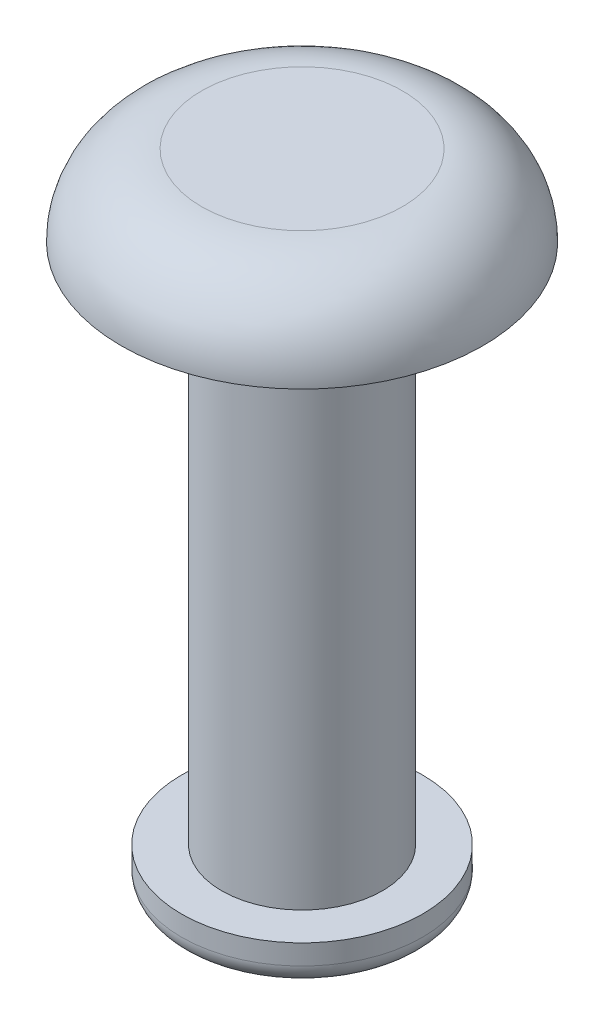
ISO-10303-21;
HEADER;
FILE_DESCRIPTION(('STEP AP214'),'2;1');
FILE_NAME('part.step','',(''),(''),'','','');
FILE_SCHEMA(('AUTOMOTIVE_DESIGN { 1 0 10303 214 1 1 1 1 }'));
ENDSEC;
DATA;
#1=APPLICATION_CONTEXT('core data for automotive mechanical design processes');
#2=APPLICATION_PROTOCOL_DEFINITION('international standard','automotive_design',2000,#1);
#3=PRODUCT_CONTEXT('',#1,'mechanical');
#4=PRODUCT('Part','Part','',(#3));
#5=PRODUCT_RELATED_PRODUCT_CATEGORY('part','',(#4));
#6=PRODUCT_DEFINITION_FORMATION('','',#4);
#7=PRODUCT_DEFINITION_CONTEXT('part definition',#1,'design');
#8=PRODUCT_DEFINITION('design','',#6,#7);
#9=PRODUCT_DEFINITION_SHAPE('','',#8);
#10=(LENGTH_UNIT() NAMED_UNIT(*) SI_UNIT(.MILLI.,.METRE.));
#11=(NAMED_UNIT(*) PLANE_ANGLE_UNIT() SI_UNIT($,.RADIAN.));
#12=(NAMED_UNIT(*) SI_UNIT($,.STERADIAN.) SOLID_ANGLE_UNIT());
#13=UNCERTAINTY_MEASURE_WITH_UNIT(LENGTH_MEASURE(1.E-05),#10,'distance_accuracy_value','');
#14=(GEOMETRIC_REPRESENTATION_CONTEXT(3) GLOBAL_UNCERTAINTY_ASSIGNED_CONTEXT((#13)) GLOBAL_UNIT_ASSIGNED_CONTEXT((#10,
#11,#12)) REPRESENTATION_CONTEXT('',''));
#15=CARTESIAN_POINT('',(0.,0.,0.));
#16=DIRECTION('',(0.,0.,1.));
#17=DIRECTION('',(1.,0.,0.));
#18=AXIS2_PLACEMENT_3D('',#15,#16,#17);
#19=CARTESIAN_POINT('',(0.,2.,0.));
#20=DIRECTION('',(0.,1.,0.));
#21=DIRECTION('',(0.,0.,1.));
#22=AXIS2_PLACEMENT_3D('',#19,#20,#21);
#23=PLANE('',#22);
#24=CARTESIAN_POINT('',(0.,2.,0.));
#25=DIRECTION('',(0.,1.,0.));
#26=DIRECTION('',(0.,0.,1.));
#27=AXIS2_PLACEMENT_3D('',#24,#25,#26);
#28=CIRCLE('',#27,2.5);
#29=CARTESIAN_POINT('',(0.,2.,2.5));
#30=VERTEX_POINT('',#29);
#31=EDGE_CURVE('E45',#30,#30,#28,.T.);
#32=ORIENTED_EDGE('',*,*,#31,.T.);
#33=EDGE_LOOP('',(#32));
#34=FACE_BOUND('',#33,.T.);
#35=ADVANCED_FACE('F34',(#34),#23,.T.);
#36=CARTESIAN_POINT('',(0.,0.,0.));
#37=DIRECTION('',(0.,1.,0.));
#38=DIRECTION('',(0.,0.,1.));
#39=AXIS2_PLACEMENT_3D('',#36,#37,#38);
#40=PLANE('',#39);
#41=CARTESIAN_POINT('',(0.,0.,0.));
#42=DIRECTION('',(0.,-1.,0.));
#43=DIRECTION('',(0.,0.,-1.));
#44=AXIS2_PLACEMENT_3D('',#41,#42,#43);
#45=CIRCLE('',#44,2.);
#46=CARTESIAN_POINT('',(0.,0.,2.));
#47=VERTEX_POINT('',#46);
#48=EDGE_CURVE('E49',#47,#47,#45,.T.);
#49=ORIENTED_EDGE('',*,*,#48,.F.);
#50=EDGE_LOOP('',(#49));
#51=FACE_BOUND('',#50,.T.);
#52=CARTESIAN_POINT('',(0.,0.,0.));
#53=DIRECTION('',(0.,1.,0.));
#54=DIRECTION('',(0.,0.,1.));
#55=AXIS2_PLACEMENT_3D('',#52,#53,#54);
#56=CIRCLE('',#55,4.5);
#57=CARTESIAN_POINT('',(0.,0.,4.5));
#58=VERTEX_POINT('',#57);
#59=EDGE_CURVE('E52',#58,#58,#56,.T.);
#60=ORIENTED_EDGE('',*,*,#59,.F.);
#61=EDGE_LOOP('',(#60));
#62=FACE_BOUND('',#61,.T.);
#63=ADVANCED_FACE('F79',(#51,#62),#40,.F.);
#64=CARTESIAN_POINT('',(0.,-13.,0.));
#65=DIRECTION('',(0.,1.,0.));
#66=DIRECTION('',(0.,0.,1.));
#67=AXIS2_PLACEMENT_3D('',#64,#65,#66);
#68=CYLINDRICAL_SURFACE('',#67,2.);
#69=CARTESIAN_POINT('',(0.,-13.,0.));
#70=DIRECTION('',(0.,-1.,0.));
#71=DIRECTION('',(0.,0.,-1.));
#72=AXIS2_PLACEMENT_3D('',#69,#70,#71);
#73=CIRCLE('',#72,2.);
#74=CARTESIAN_POINT('',(0.,-13.,2.));
#75=VERTEX_POINT('',#74);
#76=EDGE_CURVE('E55',#75,#75,#73,.T.);
#77=CARTESIAN_POINT('',(0.,-13.,2.));
#78=CARTESIAN_POINT('',(0.,-12.8645833333333,2.));
#79=CARTESIAN_POINT('',(0.,-12.7291666666667,2.));
#80=CARTESIAN_POINT('',(0.,-12.4583333333333,2.));
#81=CARTESIAN_POINT('',(0.,-12.3229166666667,2.));
#82=CARTESIAN_POINT('',(0.,-12.0520833333333,2.));
#83=CARTESIAN_POINT('',(0.,-11.9166666666667,2.));
#84=CARTESIAN_POINT('',(0.,-11.6458333333333,2.));
#85=CARTESIAN_POINT('',(0.,-11.5104166666667,2.));
#86=CARTESIAN_POINT('',(0.,-11.2395833333333,2.));
#87=CARTESIAN_POINT('',(0.,-11.1041666666667,2.));
#88=CARTESIAN_POINT('',(0.,-10.8333333333333,2.));
#89=CARTESIAN_POINT('',(0.,-10.6979166666667,2.));
#90=CARTESIAN_POINT('',(0.,-10.4270833333333,2.));
#91=CARTESIAN_POINT('',(0.,-10.2916666666667,2.));
#92=CARTESIAN_POINT('',(0.,-10.0208333333333,2.));
#93=CARTESIAN_POINT('',(0.,-9.88541666666667,2.));
#94=CARTESIAN_POINT('',(0.,-9.61458333333333,2.));
#95=CARTESIAN_POINT('',(0.,-9.47916666666667,2.));
#96=CARTESIAN_POINT('',(0.,-9.20833333333333,2.));
#97=CARTESIAN_POINT('',(0.,-9.07291666666666,2.));
#98=CARTESIAN_POINT('',(0.,-8.80208333333333,2.));
#99=CARTESIAN_POINT('',(0.,-8.66666666666667,2.));
#100=CARTESIAN_POINT('',(0.,-8.39583333333333,2.));
#101=CARTESIAN_POINT('',(0.,-8.26041666666667,2.));
#102=CARTESIAN_POINT('',(0.,-7.98958333333333,2.));
#103=CARTESIAN_POINT('',(0.,-7.85416666666667,2.));
#104=CARTESIAN_POINT('',(0.,-7.58333333333333,2.));
#105=CARTESIAN_POINT('',(0.,-7.44791666666667,2.));
#106=CARTESIAN_POINT('',(0.,-7.17708333333333,2.));
#107=CARTESIAN_POINT('',(0.,-7.04166666666667,2.));
#108=CARTESIAN_POINT('',(0.,-6.77083333333333,2.));
#109=CARTESIAN_POINT('',(0.,-6.63541666666667,2.));
#110=CARTESIAN_POINT('',(0.,-6.36458333333333,2.));
#111=CARTESIAN_POINT('',(0.,-6.22916666666667,2.));
#112=CARTESIAN_POINT('',(0.,-5.95833333333333,2.));
#113=CARTESIAN_POINT('',(0.,-5.82291666666667,2.));
#114=CARTESIAN_POINT('',(0.,-5.55208333333333,2.));
#115=CARTESIAN_POINT('',(0.,-5.41666666666667,2.));
#116=CARTESIAN_POINT('',(0.,-5.14583333333333,2.));
#117=CARTESIAN_POINT('',(0.,-5.01041666666667,2.));
#118=CARTESIAN_POINT('',(0.,-4.73958333333333,2.));
#119=CARTESIAN_POINT('',(0.,-4.60416666666667,2.));
#120=CARTESIAN_POINT('',(0.,-4.33333333333333,2.));
#121=CARTESIAN_POINT('',(0.,-4.19791666666667,2.));
#122=CARTESIAN_POINT('',(0.,-3.92708333333333,2.));
#123=CARTESIAN_POINT('',(0.,-3.79166666666667,2.));
#124=CARTESIAN_POINT('',(0.,-3.52083333333333,2.));
#125=CARTESIAN_POINT('',(0.,-3.38541666666667,2.));
#126=CARTESIAN_POINT('',(0.,-3.11458333333333,2.));
#127=CARTESIAN_POINT('',(0.,-2.97916666666667,2.));
#128=CARTESIAN_POINT('',(0.,-2.70833333333333,2.));
#129=CARTESIAN_POINT('',(0.,-2.57291666666667,2.));
#130=CARTESIAN_POINT('',(0.,-2.30208333333333,2.));
#131=CARTESIAN_POINT('',(0.,-2.16666666666667,2.));
#132=CARTESIAN_POINT('',(0.,-1.89583333333333,2.));
#133=CARTESIAN_POINT('',(0.,-1.76041666666667,2.));
#134=CARTESIAN_POINT('',(0.,-1.48958333333333,2.));
#135=CARTESIAN_POINT('',(0.,-1.35416666666667,2.));
#136=CARTESIAN_POINT('',(0.,-1.08333333333333,2.));
#137=CARTESIAN_POINT('',(0.,-0.947916666666667,2.));
#138=CARTESIAN_POINT('',(0.,-0.677083333333334,2.));
#139=CARTESIAN_POINT('',(0.,-0.541666666666667,2.));
#140=CARTESIAN_POINT('',(0.,-0.270833333333334,2.));
#141=CARTESIAN_POINT('',(0.,-0.135416666666667,2.));
#142=CARTESIAN_POINT('',(0.,0.,2.));
#143=B_SPLINE_CURVE_WITH_KNOTS('',3,(#77,#78,#79,#80,#81,#82,#83,#84,#85,#86,#87,#88,#89,#90,
#91,#92,#93,#94,#95,#96,#97,#98,#99,#100,#101,#102,#103,#104,#105,#106,#107,#108,#109,#110,#111,
#112,#113,#114,#115,#116,#117,#118,#119,#120,#121,#122,#123,#124,#125,#126,#127,#128,#129,#130,
#131,#132,#133,#134,#135,#136,#137,#138,#139,#140,#141,#142),.UNSPECIFIED.,.F.,.F.,(4,2,2,2,2,2,
2,2,2,2,2,2,2,2,2,2,2,2,2,2,2,2,2,2,2,2,2,2,2,2,2,2,4),(0.,0.40625,0.812500000000001,1.21875,
1.625,2.03125,2.4375,2.84375,3.25,3.65625,4.0625,4.46875,4.875,5.28125,5.6875,6.09375,6.5,
6.90625,7.3125,7.71875,8.125,8.53125,8.9375,9.34375,9.75,10.15625,10.5625,10.96875,11.375,
11.78125,12.1875,12.59375,13.),.UNSPECIFIED.);
#144=EDGE_CURVE('BSEAM85',#75,#47,#143,.T.);
#145=ORIENTED_EDGE('',*,*,#76,.F.);
#146=ORIENTED_EDGE('',*,*,#48,.T.);
#147=ORIENTED_EDGE('',*,*,#144,.T.);
#148=ORIENTED_EDGE('',*,*,#144,.F.);
#149=EDGE_LOOP('',(#145,#147,#146,#148));
#150=FACE_BOUND('',#149,.T.);
#151=ADVANCED_FACE('F85',(#150),#68,.T.);
#152=CARTESIAN_POINT('',(0.,0.,0.));
#153=DIRECTION('',(0.,1.,0.));
#154=DIRECTION('',(0.,0.,1.));
#155=AXIS2_PLACEMENT_3D('',#152,#153,#154);
#156=TOROIDAL_SURFACE('',#155,2.5,2.);
#157=ORIENTED_EDGE('',*,*,#59,.T.);
#158=EDGE_LOOP('',(#157));
#159=FACE_BOUND('',#158,.T.);
#160=ORIENTED_EDGE('',*,*,#31,.F.);
#161=EDGE_LOOP('',(#160));
#162=FACE_BOUND('',#161,.T.);
#163=ADVANCED_FACE('F89',(#159,#162),#156,.T.);
#164=CARTESIAN_POINT('',(0.,-14.,0.));
#165=DIRECTION('',(0.,1.,0.));
#166=DIRECTION('',(0.,0.,1.));
#167=AXIS2_PLACEMENT_3D('',#164,#165,#166);
#168=CYLINDRICAL_SURFACE('',#167,3.);
#169=CARTESIAN_POINT('',(0.,-13.5,0.));
#170=DIRECTION('',(0.,-1.,0.));
#171=DIRECTION('',(0.,0.,-1.));
#172=AXIS2_PLACEMENT_3D('',#169,#170,#171);
#173=CIRCLE('',#172,3.);
#174=CARTESIAN_POINT('',(0.,-13.5,-3.));
#175=VERTEX_POINT('',#174);
#176=EDGE_CURVE('E10',#175,#175,#173,.F.);
#177=ORIENTED_EDGE('',*,*,#176,.T.);
#178=EDGE_LOOP('',(#177));
#179=FACE_BOUND('',#178,.T.);
#180=CARTESIAN_POINT('',(0.,-13.,0.));
#181=DIRECTION('',(0.,-1.,0.));
#182=DIRECTION('',(0.,0.,-1.));
#183=AXIS2_PLACEMENT_3D('',#180,#181,#182);
#184=CIRCLE('',#183,3.);
#185=CARTESIAN_POINT('',(0.,-13.,-3.));
#186=VERTEX_POINT('',#185);
#187=EDGE_CURVE('E60',#186,#186,#184,.T.);
#188=ORIENTED_EDGE('',*,*,#187,.T.);
#189=EDGE_LOOP('',(#188));
#190=FACE_BOUND('',#189,.T.);
#191=ADVANCED_FACE('F64',(#179,#190),#168,.T.);
#192=CARTESIAN_POINT('',(0.,-14.,0.));
#193=DIRECTION('',(0.,-1.,0.));
#194=DIRECTION('',(0.,0.,-1.));
#195=AXIS2_PLACEMENT_3D('',#192,#193,#194);
#196=PLANE('',#195);
#197=CARTESIAN_POINT('',(0.,-14.,0.));
#198=DIRECTION('',(0.,-1.,0.));
#199=DIRECTION('',(0.,0.,-1.));
#200=AXIS2_PLACEMENT_3D('',#197,#198,#199);
#201=CIRCLE('',#200,2.5);
#202=CARTESIAN_POINT('',(0.,-14.,-2.5));
#203=VERTEX_POINT('',#202);
#204=EDGE_CURVE('E41',#203,#203,#201,.T.);
#205=ORIENTED_EDGE('',*,*,#204,.T.);
#206=EDGE_LOOP('',(#205));
#207=FACE_BOUND('',#206,.T.);
#208=ADVANCED_FACE('F68',(#207),#196,.T.);
#209=CARTESIAN_POINT('',(0.,-13.,0.));
#210=DIRECTION('',(0.,-1.,0.));
#211=DIRECTION('',(0.,0.,-1.));
#212=AXIS2_PLACEMENT_3D('',#209,#210,#211);
#213=PLANE('',#212);
#214=ORIENTED_EDGE('',*,*,#76,.T.);
#215=EDGE_LOOP('',(#214));
#216=FACE_BOUND('',#215,.T.);
#217=ORIENTED_EDGE('',*,*,#187,.F.);
#218=EDGE_LOOP('',(#217));
#219=FACE_BOUND('',#218,.T.);
#220=ADVANCED_FACE('F66',(#216,#219),#213,.F.);
#221=CARTESIAN_POINT('',(0.,-13.5,0.));
#222=DIRECTION('',(0.,-1.,0.));
#223=DIRECTION('',(0.,0.,-1.));
#224=AXIS2_PLACEMENT_3D('',#221,#222,#223);
#225=TOROIDAL_SURFACE('',#224,2.5,0.5);
#226=ORIENTED_EDGE('',*,*,#176,.F.);
#227=EDGE_LOOP('',(#226));
#228=FACE_BOUND('',#227,.T.);
#229=ORIENTED_EDGE('',*,*,#204,.F.);
#230=EDGE_LOOP('',(#229));
#231=FACE_BOUND('',#230,.T.);
#232=ADVANCED_FACE('F36',(#228,#231),#225,.T.);
#233=CLOSED_SHELL('',(#35,#63,#151,#163,#191,#208,#220,#232));
#234=MANIFOLD_SOLID_BREP('B2',#233);
#235=ADVANCED_BREP_SHAPE_REPRESENTATION('',(#18,#234),#14);
#236=SHAPE_DEFINITION_REPRESENTATION(#9,#235);
ENDSEC;
END-ISO-10303-21;
